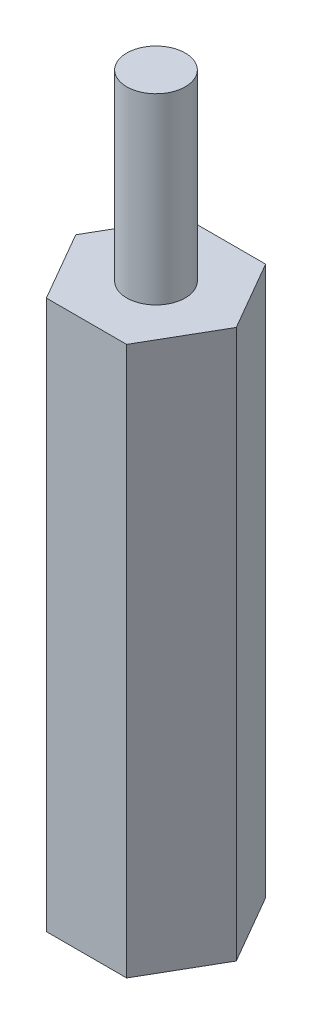
ISO-10303-21;
HEADER;
FILE_DESCRIPTION(('STEP AP214'),'2;1');
FILE_NAME('part.step','',(''),(''),'','','');
FILE_SCHEMA(('AUTOMOTIVE_DESIGN { 1 0 10303 214 1 1 1 1 }'));
ENDSEC;
DATA;
#1=APPLICATION_CONTEXT('core data for automotive mechanical design processes');
#2=APPLICATION_PROTOCOL_DEFINITION('international standard','automotive_design',2000,#1);
#3=PRODUCT_CONTEXT('',#1,'mechanical');
#4=PRODUCT('Part','Part','',(#3));
#5=PRODUCT_RELATED_PRODUCT_CATEGORY('part','',(#4));
#6=PRODUCT_DEFINITION_FORMATION('','',#4);
#7=PRODUCT_DEFINITION_CONTEXT('part definition',#1,'design');
#8=PRODUCT_DEFINITION('design','',#6,#7);
#9=PRODUCT_DEFINITION_SHAPE('','',#8);
#10=(LENGTH_UNIT() NAMED_UNIT(*) SI_UNIT(.MILLI.,.METRE.));
#11=(NAMED_UNIT(*) PLANE_ANGLE_UNIT() SI_UNIT($,.RADIAN.));
#12=(NAMED_UNIT(*) SI_UNIT($,.STERADIAN.) SOLID_ANGLE_UNIT());
#13=UNCERTAINTY_MEASURE_WITH_UNIT(LENGTH_MEASURE(1.E-05),#10,'distance_accuracy_value','');
#14=(GEOMETRIC_REPRESENTATION_CONTEXT(3) GLOBAL_UNCERTAINTY_ASSIGNED_CONTEXT((#13)) GLOBAL_UNIT_ASSIGNED_CONTEXT((#10,
#11,#12)) REPRESENTATION_CONTEXT('',''));
#15=CARTESIAN_POINT('',(0.,0.,0.));
#16=DIRECTION('',(0.,0.,1.));
#17=DIRECTION('',(1.,0.,0.));
#18=AXIS2_PLACEMENT_3D('',#15,#16,#17);
#19=CARTESIAN_POINT('',(-1.39314619955457,19.05,2.413));
#20=DIRECTION('',(0.,0.,-1.));
#21=DIRECTION('',(-1.,0.,0.));
#22=AXIS2_PLACEMENT_3D('',#19,#20,#21);
#23=PLANE('',#22);
#24=DIRECTION('',(1.,0.,0.));
#25=VECTOR('',#24,1.);
#26=CARTESIAN_POINT('',(-1.39314619955457,0.,2.413));
#27=LINE('',#26,#25);
#28=CARTESIAN_POINT('',(-1.39314619955457,0.,2.413));
#29=VERTEX_POINT('',#28);
#30=CARTESIAN_POINT('',(1.39314619955457,0.,2.413));
#31=VERTEX_POINT('',#30);
#32=EDGE_CURVE('E119',#29,#31,#27,.T.);
#33=ORIENTED_EDGE('',*,*,#32,.T.);
#34=DIRECTION('',(0.,-1.,0.));
#35=VECTOR('',#34,1.);
#36=CARTESIAN_POINT('',(1.39314619955457,19.05,2.413));
#37=LINE('',#36,#35);
#38=CARTESIAN_POINT('',(1.39314619955457,19.05,2.413));
#39=VERTEX_POINT('',#38);
#40=EDGE_CURVE('E36',#39,#31,#37,.T.);
#41=ORIENTED_EDGE('',*,*,#40,.F.);
#42=DIRECTION('',(1.,0.,0.));
#43=VECTOR('',#42,1.);
#44=CARTESIAN_POINT('',(-1.39314619955457,19.05,2.413));
#45=LINE('',#44,#43);
#46=CARTESIAN_POINT('',(-1.39314619955457,19.05,2.413));
#47=VERTEX_POINT('',#46);
#48=EDGE_CURVE('E130',#47,#39,#45,.T.);
#49=ORIENTED_EDGE('',*,*,#48,.F.);
#50=DIRECTION('',(0.,-1.,0.));
#51=VECTOR('',#50,1.);
#52=CARTESIAN_POINT('',(-1.39314619955457,19.05,2.413));
#53=LINE('',#52,#51);
#54=EDGE_CURVE('E115',#47,#29,#53,.T.);
#55=ORIENTED_EDGE('',*,*,#54,.T.);
#56=EDGE_LOOP('',(#33,#41,#49,#55));
#57=FACE_BOUND('',#56,.T.);
#58=ADVANCED_FACE('F33',(#57),#23,.F.);
#59=CARTESIAN_POINT('',(1.39314619955457,19.05,2.413));
#60=DIRECTION('',(-0.866025403784439,0.,-0.5));
#61=DIRECTION('',(-0.5,0.,0.866025403784438));
#62=AXIS2_PLACEMENT_3D('',#59,#60,#61);
#63=PLANE('',#62);
#64=DIRECTION('',(0.5,0.,-0.866025403784439));
#65=VECTOR('',#64,1.);
#66=CARTESIAN_POINT('',(1.39314619955457,0.,2.413));
#67=LINE('',#66,#65);
#68=CARTESIAN_POINT('',(2.78629239910913,0.,0.));
#69=VERTEX_POINT('',#68);
#70=EDGE_CURVE('E122',#31,#69,#67,.T.);
#71=ORIENTED_EDGE('',*,*,#70,.T.);
#72=DIRECTION('',(0.,-1.,0.));
#73=VECTOR('',#72,1.);
#74=CARTESIAN_POINT('',(2.78629239910913,19.05,0.));
#75=LINE('',#74,#73);
#76=CARTESIAN_POINT('',(2.78629239910913,19.05,0.));
#77=VERTEX_POINT('',#76);
#78=EDGE_CURVE('E133',#77,#69,#75,.T.);
#79=ORIENTED_EDGE('',*,*,#78,.F.);
#80=DIRECTION('',(0.5,0.,-0.866025403784439));
#81=VECTOR('',#80,1.);
#82=CARTESIAN_POINT('',(1.39314619955457,19.05,2.413));
#83=LINE('',#82,#81);
#84=EDGE_CURVE('E88',#39,#77,#83,.T.);
#85=ORIENTED_EDGE('',*,*,#84,.F.);
#86=ORIENTED_EDGE('',*,*,#40,.T.);
#87=EDGE_LOOP('',(#71,#79,#85,#86));
#88=FACE_BOUND('',#87,.T.);
#89=ADVANCED_FACE('F138',(#88),#63,.F.);
#90=CARTESIAN_POINT('',(2.78629239910913,19.05,0.));
#91=DIRECTION('',(-0.866025403784439,0.,0.5));
#92=DIRECTION('',(0.5,0.,0.866025403784439));
#93=AXIS2_PLACEMENT_3D('',#90,#91,#92);
#94=PLANE('',#93);
#95=DIRECTION('',(-0.5,0.,-0.866025403784439));
#96=VECTOR('',#95,1.);
#97=CARTESIAN_POINT('',(2.78629239910913,0.,0.));
#98=LINE('',#97,#96);
#99=CARTESIAN_POINT('',(1.39314619955457,0.,-2.413));
#100=VERTEX_POINT('',#99);
#101=EDGE_CURVE('E125',#69,#100,#98,.T.);
#102=ORIENTED_EDGE('',*,*,#101,.T.);
#103=DIRECTION('',(0.,-1.,0.));
#104=VECTOR('',#103,1.);
#105=CARTESIAN_POINT('',(1.39314619955457,19.05,-2.413));
#106=LINE('',#105,#104);
#107=CARTESIAN_POINT('',(1.39314619955457,19.05,-2.413));
#108=VERTEX_POINT('',#107);
#109=EDGE_CURVE('E110',#108,#100,#106,.T.);
#110=ORIENTED_EDGE('',*,*,#109,.F.);
#111=DIRECTION('',(-0.5,0.,-0.866025403784439));
#112=VECTOR('',#111,1.);
#113=CARTESIAN_POINT('',(2.78629239910913,19.05,0.));
#114=LINE('',#113,#112);
#115=EDGE_CURVE('E101',#77,#108,#114,.T.);
#116=ORIENTED_EDGE('',*,*,#115,.F.);
#117=ORIENTED_EDGE('',*,*,#78,.T.);
#118=EDGE_LOOP('',(#102,#110,#116,#117));
#119=FACE_BOUND('',#118,.T.);
#120=ADVANCED_FACE('F144',(#119),#94,.F.);
#121=CARTESIAN_POINT('',(1.39314619955457,19.05,-2.413));
#122=DIRECTION('',(0.,0.,1.));
#123=DIRECTION('',(1.,0.,0.));
#124=AXIS2_PLACEMENT_3D('',#121,#122,#123);
#125=PLANE('',#124);
#126=DIRECTION('',(-1.,0.,0.));
#127=VECTOR('',#126,1.);
#128=CARTESIAN_POINT('',(1.39314619955457,0.,-2.413));
#129=LINE('',#128,#127);
#130=CARTESIAN_POINT('',(-1.39314619955457,0.,-2.413));
#131=VERTEX_POINT('',#130);
#132=EDGE_CURVE('E109',#100,#131,#129,.T.);
#133=ORIENTED_EDGE('',*,*,#132,.T.);
#134=DIRECTION('',(0.,-1.,0.));
#135=VECTOR('',#134,1.);
#136=CARTESIAN_POINT('',(-1.39314619955457,19.05,-2.413));
#137=LINE('',#136,#135);
#138=CARTESIAN_POINT('',(-1.39314619955457,19.05,-2.413));
#139=VERTEX_POINT('',#138);
#140=EDGE_CURVE('E106',#139,#131,#137,.T.);
#141=ORIENTED_EDGE('',*,*,#140,.F.);
#142=DIRECTION('',(-1.,0.,0.));
#143=VECTOR('',#142,1.);
#144=CARTESIAN_POINT('',(1.39314619955457,19.05,-2.413));
#145=LINE('',#144,#143);
#146=EDGE_CURVE('E95',#108,#139,#145,.T.);
#147=ORIENTED_EDGE('',*,*,#146,.F.);
#148=ORIENTED_EDGE('',*,*,#109,.T.);
#149=EDGE_LOOP('',(#133,#141,#147,#148));
#150=FACE_BOUND('',#149,.T.);
#151=ADVANCED_FACE('F107',(#150),#125,.F.);
#152=CARTESIAN_POINT('',(-1.39314619955457,19.05,-2.413));
#153=DIRECTION('',(0.866025403784438,0.,0.5));
#154=DIRECTION('',(0.5,0.,-0.866025403784438));
#155=AXIS2_PLACEMENT_3D('',#152,#153,#154);
#156=PLANE('',#155);
#157=DIRECTION('',(-0.5,0.,0.866025403784438));
#158=VECTOR('',#157,1.);
#159=CARTESIAN_POINT('',(-1.39314619955457,0.,-2.413));
#160=LINE('',#159,#158);
#161=CARTESIAN_POINT('',(-2.78629239910913,0.,0.));
#162=VERTEX_POINT('',#161);
#163=EDGE_CURVE('E73',#131,#162,#160,.T.);
#164=ORIENTED_EDGE('',*,*,#163,.T.);
#165=DIRECTION('',(0.,-1.,0.));
#166=VECTOR('',#165,1.);
#167=CARTESIAN_POINT('',(-2.78629239910913,19.05,0.));
#168=LINE('',#167,#166);
#169=CARTESIAN_POINT('',(-2.78629239910913,19.05,0.));
#170=VERTEX_POINT('',#169);
#171=EDGE_CURVE('E111',#170,#162,#168,.T.);
#172=ORIENTED_EDGE('',*,*,#171,.F.);
#173=DIRECTION('',(-0.5,0.,0.866025403784438));
#174=VECTOR('',#173,1.);
#175=CARTESIAN_POINT('',(-1.39314619955457,19.05,-2.413));
#176=LINE('',#175,#174);
#177=EDGE_CURVE('E99',#139,#170,#176,.T.);
#178=ORIENTED_EDGE('',*,*,#177,.F.);
#179=ORIENTED_EDGE('',*,*,#140,.T.);
#180=EDGE_LOOP('',(#164,#172,#178,#179));
#181=FACE_BOUND('',#180,.T.);
#182=ADVANCED_FACE('F113',(#181),#156,.F.);
#183=CARTESIAN_POINT('',(-2.78629239910913,19.05,0.));
#184=DIRECTION('',(0.866025403784439,0.,-0.5));
#185=DIRECTION('',(-0.5,0.,-0.866025403784439));
#186=AXIS2_PLACEMENT_3D('',#183,#184,#185);
#187=PLANE('',#186);
#188=DIRECTION('',(0.5,0.,0.866025403784439));
#189=VECTOR('',#188,1.);
#190=CARTESIAN_POINT('',(-2.78629239910913,0.,0.));
#191=LINE('',#190,#189);
#192=EDGE_CURVE('E79',#162,#29,#191,.T.);
#193=ORIENTED_EDGE('',*,*,#192,.T.);
#194=ORIENTED_EDGE('',*,*,#54,.F.);
#195=DIRECTION('',(0.5,0.,0.866025403784439));
#196=VECTOR('',#195,1.);
#197=CARTESIAN_POINT('',(-2.78629239910913,19.05,0.));
#198=LINE('',#197,#196);
#199=EDGE_CURVE('E50',#170,#47,#198,.T.);
#200=ORIENTED_EDGE('',*,*,#199,.F.);
#201=ORIENTED_EDGE('',*,*,#171,.T.);
#202=EDGE_LOOP('',(#193,#194,#200,#201));
#203=FACE_BOUND('',#202,.T.);
#204=ADVANCED_FACE('F175',(#203),#187,.F.);
#205=CARTESIAN_POINT('',(0.,19.05,0.));
#206=DIRECTION('',(0.,1.,0.));
#207=DIRECTION('',(0.,0.,1.));
#208=AXIS2_PLACEMENT_3D('',#205,#206,#207);
#209=PLANE('',#208);
#210=CARTESIAN_POINT('',(0.,19.05,0.));
#211=DIRECTION('',(0.,1.,0.));
#212=DIRECTION('',(0.,0.,1.));
#213=AXIS2_PLACEMENT_3D('',#210,#211,#212);
#214=CIRCLE('',#213,1.016);
#215=CARTESIAN_POINT('',(0.,19.05,1.016));
#216=VERTEX_POINT('',#215);
#217=EDGE_CURVE('E11',#216,#216,#214,.T.);
#218=ORIENTED_EDGE('',*,*,#217,.F.);
#219=EDGE_LOOP('',(#218));
#220=FACE_BOUND('',#219,.T.);
#221=ORIENTED_EDGE('',*,*,#48,.T.);
#222=ORIENTED_EDGE('',*,*,#84,.T.);
#223=ORIENTED_EDGE('',*,*,#115,.T.);
#224=ORIENTED_EDGE('',*,*,#146,.T.);
#225=ORIENTED_EDGE('',*,*,#177,.T.);
#226=ORIENTED_EDGE('',*,*,#199,.T.);
#227=EDGE_LOOP('',(#221,#222,#223,#224,#225,#226));
#228=FACE_BOUND('',#227,.T.);
#229=ADVANCED_FACE('F97',(#220,#228),#209,.T.);
#230=CARTESIAN_POINT('',(0.,0.,0.));
#231=DIRECTION('',(0.,1.,0.));
#232=DIRECTION('',(0.,0.,1.));
#233=AXIS2_PLACEMENT_3D('',#230,#231,#232);
#234=PLANE('',#233);
#235=CARTESIAN_POINT('',(0.,0.,0.));
#236=DIRECTION('',(0.,-1.,0.));
#237=DIRECTION('',(0.,0.,-1.));
#238=AXIS2_PLACEMENT_3D('',#235,#236,#237);
#239=CIRCLE('',#238,1.016);
#240=CARTESIAN_POINT('',(0.,0.,-1.016));
#241=VERTEX_POINT('',#240);
#242=EDGE_CURVE('E151',#241,#241,#239,.T.);
#243=ORIENTED_EDGE('',*,*,#242,.F.);
#244=EDGE_LOOP('',(#243));
#245=FACE_BOUND('',#244,.T.);
#246=ORIENTED_EDGE('',*,*,#32,.F.);
#247=ORIENTED_EDGE('',*,*,#192,.F.);
#248=ORIENTED_EDGE('',*,*,#163,.F.);
#249=ORIENTED_EDGE('',*,*,#132,.F.);
#250=ORIENTED_EDGE('',*,*,#101,.F.);
#251=ORIENTED_EDGE('',*,*,#70,.F.);
#252=EDGE_LOOP('',(#246,#247,#248,#249,#250,#251));
#253=FACE_BOUND('',#252,.T.);
#254=ADVANCED_FACE('F143',(#245,#253),#234,.F.);
#255=CARTESIAN_POINT('',(0.,25.4,0.));
#256=DIRECTION('',(0.,-1.,0.));
#257=DIRECTION('',(0.,0.,-1.));
#258=AXIS2_PLACEMENT_3D('',#255,#256,#257);
#259=CYLINDRICAL_SURFACE('',#258,1.016);
#260=CARTESIAN_POINT('',(0.,25.4,0.));
#261=DIRECTION('',(0.,1.,0.));
#262=DIRECTION('',(0.,0.,1.));
#263=AXIS2_PLACEMENT_3D('',#260,#261,#262);
#264=CIRCLE('',#263,1.016);
#265=CARTESIAN_POINT('',(0.,25.4,1.016));
#266=VERTEX_POINT('',#265);
#267=EDGE_CURVE('E123',#266,#266,#264,.T.);
#268=ORIENTED_EDGE('',*,*,#267,.F.);
#269=EDGE_LOOP('',(#268));
#270=FACE_BOUND('',#269,.T.);
#271=ORIENTED_EDGE('',*,*,#217,.T.);
#272=EDGE_LOOP('',(#271));
#273=FACE_BOUND('',#272,.T.);
#274=ADVANCED_FACE('F167',(#270,#273),#259,.T.);
#275=CARTESIAN_POINT('',(0.,25.4,0.));
#276=DIRECTION('',(0.,1.,0.));
#277=DIRECTION('',(0.,0.,1.));
#278=AXIS2_PLACEMENT_3D('',#275,#276,#277);
#279=PLANE('',#278);
#280=ORIENTED_EDGE('',*,*,#267,.T.);
#281=EDGE_LOOP('',(#280));
#282=FACE_BOUND('',#281,.T.);
#283=ADVANCED_FACE('F162',(#282),#279,.T.);
#284=CARTESIAN_POINT('',(0.,6.35,0.));
#285=DIRECTION('',(0.,-1.,0.));
#286=DIRECTION('',(0.,0.,-1.));
#287=AXIS2_PLACEMENT_3D('',#284,#285,#286);
#288=CYLINDRICAL_SURFACE('',#287,1.016);
#289=CARTESIAN_POINT('',(0.,6.35,0.));
#290=DIRECTION('',(0.,-1.,0.));
#291=DIRECTION('',(0.,0.,-1.));
#292=AXIS2_PLACEMENT_3D('',#289,#290,#291);
#293=CIRCLE('',#292,1.016);
#294=CARTESIAN_POINT('',(0.,6.35,-1.016));
#295=VERTEX_POINT('',#294);
#296=EDGE_CURVE('E150',#295,#295,#293,.T.);
#297=ORIENTED_EDGE('',*,*,#296,.F.);
#298=EDGE_LOOP('',(#297));
#299=FACE_BOUND('',#298,.T.);
#300=ORIENTED_EDGE('',*,*,#242,.T.);
#301=EDGE_LOOP('',(#300));
#302=FACE_BOUND('',#301,.T.);
#303=ADVANCED_FACE('F159',(#299,#302),#288,.F.);
#304=CARTESIAN_POINT('',(0.,6.35,0.));
#305=DIRECTION('',(0.,-1.,0.));
#306=DIRECTION('',(0.,0.,-1.));
#307=AXIS2_PLACEMENT_3D('',#304,#305,#306);
#308=PLANE('',#307);
#309=ORIENTED_EDGE('',*,*,#296,.T.);
#310=EDGE_LOOP('',(#309));
#311=FACE_BOUND('',#310,.T.);
#312=ADVANCED_FACE('F157',(#311),#308,.T.);
#313=CLOSED_SHELL('',(#58,#89,#120,#151,#182,#204,#229,#254,#274,#283,#303,#312));
#314=MANIFOLD_SOLID_BREP('B2',#313);
#315=ADVANCED_BREP_SHAPE_REPRESENTATION('',(#18,#314),#14);
#316=SHAPE_DEFINITION_REPRESENTATION(#9,#315);
ENDSEC;
END-ISO-10303-21;
